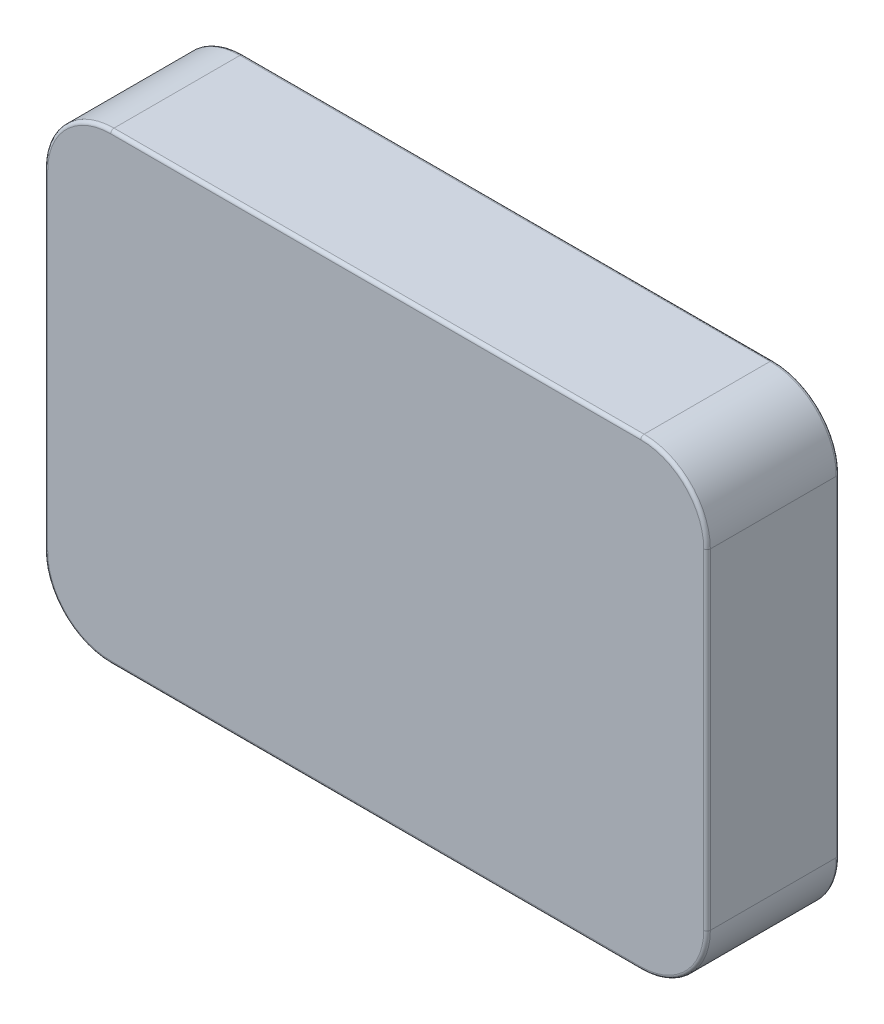
ISO-10303-21;
HEADER;
FILE_DESCRIPTION(('STEP AP214'),'2;1');
FILE_NAME('part.step','',(''),(''),'','','');
FILE_SCHEMA(('AUTOMOTIVE_DESIGN { 1 0 10303 214 1 1 1 1 }'));
ENDSEC;
DATA;
#1=APPLICATION_CONTEXT('core data for automotive mechanical design processes');
#2=APPLICATION_PROTOCOL_DEFINITION('international standard','automotive_design',2000,#1);
#3=PRODUCT_CONTEXT('',#1,'mechanical');
#4=PRODUCT('Part','Part','',(#3));
#5=PRODUCT_RELATED_PRODUCT_CATEGORY('part','',(#4));
#6=PRODUCT_DEFINITION_FORMATION('','',#4);
#7=PRODUCT_DEFINITION_CONTEXT('part definition',#1,'design');
#8=PRODUCT_DEFINITION('design','',#6,#7);
#9=PRODUCT_DEFINITION_SHAPE('','',#8);
#10=(LENGTH_UNIT() NAMED_UNIT(*) SI_UNIT(.MILLI.,.METRE.));
#11=(NAMED_UNIT(*) PLANE_ANGLE_UNIT() SI_UNIT($,.RADIAN.));
#12=(NAMED_UNIT(*) SI_UNIT($,.STERADIAN.) SOLID_ANGLE_UNIT());
#13=UNCERTAINTY_MEASURE_WITH_UNIT(LENGTH_MEASURE(1.E-05),#10,'distance_accuracy_value','');
#14=(GEOMETRIC_REPRESENTATION_CONTEXT(3) GLOBAL_UNCERTAINTY_ASSIGNED_CONTEXT((#13)) GLOBAL_UNIT_ASSIGNED_CONTEXT((#10,
#11,#12)) REPRESENTATION_CONTEXT('',''));
#15=CARTESIAN_POINT('',(0.,0.,0.));
#16=DIRECTION('',(0.,0.,1.));
#17=DIRECTION('',(1.,0.,0.));
#18=AXIS2_PLACEMENT_3D('',#15,#16,#17);
#19=CARTESIAN_POINT('',(50.,-34.925,20.));
#20=DIRECTION('',(-1.,0.,0.));
#21=DIRECTION('',(0.,0.,1.));
#22=AXIS2_PLACEMENT_3D('',#19,#20,#21);
#23=PLANE('',#22);
#24=DIRECTION('',(0.,0.,-1.));
#25=VECTOR('',#24,1.);
#26=CARTESIAN_POINT('',(50.,-24.925,20.));
#27=LINE('',#26,#25);
#28=CARTESIAN_POINT('',(50.,-24.925,19.5));
#29=VERTEX_POINT('',#28);
#30=CARTESIAN_POINT('',(50.,-24.925,0.5));
#31=VERTEX_POINT('',#30);
#32=EDGE_CURVE('E300',#29,#31,#27,.T.);
#33=ORIENTED_EDGE('',*,*,#32,.T.);
#34=DIRECTION('',(0.,1.,0.));
#35=VECTOR('',#34,1.);
#36=CARTESIAN_POINT('',(50.,24.925,0.5));
#37=LINE('',#36,#35);
#38=CARTESIAN_POINT('',(50.,24.925,0.5));
#39=VERTEX_POINT('',#38);
#40=EDGE_CURVE('E199',#31,#39,#37,.T.);
#41=ORIENTED_EDGE('',*,*,#40,.T.);
#42=DIRECTION('',(0.,0.,-1.));
#43=VECTOR('',#42,1.);
#44=CARTESIAN_POINT('',(50.,24.925,20.));
#45=LINE('',#44,#43);
#46=CARTESIAN_POINT('',(50.,24.925,19.5));
#47=VERTEX_POINT('',#46);
#48=EDGE_CURVE('E296',#39,#47,#45,.F.);
#49=ORIENTED_EDGE('',*,*,#48,.T.);
#50=DIRECTION('',(0.,1.,0.));
#51=VECTOR('',#50,1.);
#52=CARTESIAN_POINT('',(50.,-34.925,19.5));
#53=LINE('',#52,#51);
#54=EDGE_CURVE('E197',#47,#29,#53,.F.);
#55=ORIENTED_EDGE('',*,*,#54,.T.);
#56=EDGE_LOOP('',(#33,#41,#49,#55));
#57=FACE_BOUND('',#56,.T.);
#58=ADVANCED_FACE('F34',(#57),#23,.F.);
#59=CARTESIAN_POINT('',(-50.,34.925,20.));
#60=DIRECTION('',(0.,-1.,0.));
#61=DIRECTION('',(0.,0.,-1.));
#62=AXIS2_PLACEMENT_3D('',#59,#60,#61);
#63=PLANE('',#62);
#64=DIRECTION('',(0.,0.,-1.));
#65=VECTOR('',#64,1.);
#66=CARTESIAN_POINT('',(40.,34.925,20.));
#67=LINE('',#66,#65);
#68=CARTESIAN_POINT('',(40.,34.925,19.5));
#69=VERTEX_POINT('',#68);
#70=CARTESIAN_POINT('',(40.,34.925,0.5));
#71=VERTEX_POINT('',#70);
#72=EDGE_CURVE('E173',#69,#71,#67,.T.);
#73=ORIENTED_EDGE('',*,*,#72,.T.);
#74=DIRECTION('',(-1.,0.,0.));
#75=VECTOR('',#74,1.);
#76=CARTESIAN_POINT('',(-40.,34.925,0.5));
#77=LINE('',#76,#75);
#78=CARTESIAN_POINT('',(-40.,34.925,0.5));
#79=VERTEX_POINT('',#78);
#80=EDGE_CURVE('E11',#71,#79,#77,.T.);
#81=ORIENTED_EDGE('',*,*,#80,.T.);
#82=DIRECTION('',(0.,0.,-1.));
#83=VECTOR('',#82,1.);
#84=CARTESIAN_POINT('',(-40.,34.925,20.));
#85=LINE('',#84,#83);
#86=CARTESIAN_POINT('',(-40.,34.925,19.5));
#87=VERTEX_POINT('',#86);
#88=EDGE_CURVE('E176',#79,#87,#85,.F.);
#89=ORIENTED_EDGE('',*,*,#88,.T.);
#90=DIRECTION('',(-1.,0.,0.));
#91=VECTOR('',#90,1.);
#92=CARTESIAN_POINT('',(-50.,34.925,19.5));
#93=LINE('',#92,#91);
#94=EDGE_CURVE('E43',#87,#69,#93,.F.);
#95=ORIENTED_EDGE('',*,*,#94,.T.);
#96=EDGE_LOOP('',(#73,#81,#89,#95));
#97=FACE_BOUND('',#96,.T.);
#98=ADVANCED_FACE('F310',(#97),#63,.F.);
#99=CARTESIAN_POINT('',(-50.,-34.925,20.));
#100=DIRECTION('',(1.,0.,0.));
#101=DIRECTION('',(0.,0.,-1.));
#102=AXIS2_PLACEMENT_3D('',#99,#100,#101);
#103=PLANE('',#102);
#104=DIRECTION('',(0.,0.,-1.));
#105=VECTOR('',#104,1.);
#106=CARTESIAN_POINT('',(-50.,24.925,20.));
#107=LINE('',#106,#105);
#108=CARTESIAN_POINT('',(-50.,24.925,19.5));
#109=VERTEX_POINT('',#108);
#110=CARTESIAN_POINT('',(-50.,24.925,0.5));
#111=VERTEX_POINT('',#110);
#112=EDGE_CURVE('E297',#109,#111,#107,.T.);
#113=ORIENTED_EDGE('',*,*,#112,.T.);
#114=DIRECTION('',(0.,-1.,0.));
#115=VECTOR('',#114,1.);
#116=CARTESIAN_POINT('',(-50.,-24.925,0.5));
#117=LINE('',#116,#115);
#118=CARTESIAN_POINT('',(-50.,-24.925,0.5));
#119=VERTEX_POINT('',#118);
#120=EDGE_CURVE('E215',#111,#119,#117,.T.);
#121=ORIENTED_EDGE('',*,*,#120,.T.);
#122=DIRECTION('',(0.,0.,-1.));
#123=VECTOR('',#122,1.);
#124=CARTESIAN_POINT('',(-50.,-24.925,20.));
#125=LINE('',#124,#123);
#126=CARTESIAN_POINT('',(-50.,-24.925,19.5));
#127=VERTEX_POINT('',#126);
#128=EDGE_CURVE('E287',#119,#127,#125,.F.);
#129=ORIENTED_EDGE('',*,*,#128,.T.);
#130=DIRECTION('',(0.,-1.,0.));
#131=VECTOR('',#130,1.);
#132=CARTESIAN_POINT('',(-50.,-34.925,19.5));
#133=LINE('',#132,#131);
#134=EDGE_CURVE('E213',#127,#109,#133,.F.);
#135=ORIENTED_EDGE('',*,*,#134,.T.);
#136=EDGE_LOOP('',(#113,#121,#129,#135));
#137=FACE_BOUND('',#136,.T.);
#138=ADVANCED_FACE('F293',(#137),#103,.F.);
#139=CARTESIAN_POINT('',(-50.,-34.925,20.));
#140=DIRECTION('',(0.,1.,0.));
#141=DIRECTION('',(0.,0.,1.));
#142=AXIS2_PLACEMENT_3D('',#139,#140,#141);
#143=PLANE('',#142);
#144=DIRECTION('',(0.,0.,-1.));
#145=VECTOR('',#144,1.);
#146=CARTESIAN_POINT('',(-40.,-34.925,20.));
#147=LINE('',#146,#145);
#148=CARTESIAN_POINT('',(-40.,-34.925,19.5));
#149=VERTEX_POINT('',#148);
#150=CARTESIAN_POINT('',(-40.,-34.925,0.5));
#151=VERTEX_POINT('',#150);
#152=EDGE_CURVE('E290',#149,#151,#147,.T.);
#153=ORIENTED_EDGE('',*,*,#152,.T.);
#154=DIRECTION('',(1.,0.,0.));
#155=VECTOR('',#154,1.);
#156=CARTESIAN_POINT('',(40.,-34.925,0.5));
#157=LINE('',#156,#155);
#158=CARTESIAN_POINT('',(40.,-34.925,0.5));
#159=VERTEX_POINT('',#158);
#160=EDGE_CURVE('E207',#151,#159,#157,.T.);
#161=ORIENTED_EDGE('',*,*,#160,.T.);
#162=DIRECTION('',(0.,0.,-1.));
#163=VECTOR('',#162,1.);
#164=CARTESIAN_POINT('',(40.,-34.925,20.));
#165=LINE('',#164,#163);
#166=CARTESIAN_POINT('',(40.,-34.925,19.5));
#167=VERTEX_POINT('',#166);
#168=EDGE_CURVE('E250',#159,#167,#165,.F.);
#169=ORIENTED_EDGE('',*,*,#168,.T.);
#170=DIRECTION('',(1.,0.,0.));
#171=VECTOR('',#170,1.);
#172=CARTESIAN_POINT('',(-50.,-34.925,19.5));
#173=LINE('',#172,#171);
#174=EDGE_CURVE('E205',#167,#149,#173,.F.);
#175=ORIENTED_EDGE('',*,*,#174,.T.);
#176=EDGE_LOOP('',(#153,#161,#169,#175));
#177=FACE_BOUND('',#176,.T.);
#178=ADVANCED_FACE('F539',(#177),#143,.F.);
#179=CARTESIAN_POINT('',(0.,0.,20.));
#180=DIRECTION('',(0.,0.,-1.));
#181=DIRECTION('',(-1.,0.,0.));
#182=AXIS2_PLACEMENT_3D('',#179,#180,#181);
#183=PLANE('',#182);
#184=DIRECTION('',(0.,1.,0.));
#185=VECTOR('',#184,1.);
#186=CARTESIAN_POINT('',(49.5,0.,20.));
#187=LINE('',#186,#185);
#188=CARTESIAN_POINT('',(49.5,-24.925,20.));
#189=VERTEX_POINT('',#188);
#190=CARTESIAN_POINT('',(49.5,24.925,20.));
#191=VERTEX_POINT('',#190);
#192=EDGE_CURVE('E51',#189,#191,#187,.T.);
#193=ORIENTED_EDGE('',*,*,#192,.T.);
#194=CARTESIAN_POINT('',(40.,24.925,20.));
#195=DIRECTION('',(0.,0.,-1.));
#196=DIRECTION('',(-1.,0.,0.));
#197=AXIS2_PLACEMENT_3D('',#194,#195,#196);
#198=CIRCLE('',#197,9.5);
#199=CARTESIAN_POINT('',(40.,34.425,20.));
#200=VERTEX_POINT('',#199);
#201=EDGE_CURVE('E232',#191,#200,#198,.F.);
#202=ORIENTED_EDGE('',*,*,#201,.T.);
#203=DIRECTION('',(-1.,0.,0.));
#204=VECTOR('',#203,1.);
#205=CARTESIAN_POINT('',(0.,34.425,20.));
#206=LINE('',#205,#204);
#207=CARTESIAN_POINT('',(-40.,34.425,20.));
#208=VERTEX_POINT('',#207);
#209=EDGE_CURVE('E220',#200,#208,#206,.T.);
#210=ORIENTED_EDGE('',*,*,#209,.T.);
#211=CARTESIAN_POINT('',(-40.,24.925,20.));
#212=DIRECTION('',(0.,0.,-1.));
#213=DIRECTION('',(-1.,0.,0.));
#214=AXIS2_PLACEMENT_3D('',#211,#212,#213);
#215=CIRCLE('',#214,9.5);
#216=CARTESIAN_POINT('',(-49.5,24.925,20.));
#217=VERTEX_POINT('',#216);
#218=EDGE_CURVE('E222',#208,#217,#215,.F.);
#219=ORIENTED_EDGE('',*,*,#218,.T.);
#220=DIRECTION('',(0.,-1.,0.));
#221=VECTOR('',#220,1.);
#222=CARTESIAN_POINT('',(-49.5,0.,20.));
#223=LINE('',#222,#221);
#224=CARTESIAN_POINT('',(-49.5,-24.925,20.));
#225=VERTEX_POINT('',#224);
#226=EDGE_CURVE('E224',#217,#225,#223,.T.);
#227=ORIENTED_EDGE('',*,*,#226,.T.);
#228=CARTESIAN_POINT('',(-40.,-24.925,20.));
#229=DIRECTION('',(0.,0.,-1.));
#230=DIRECTION('',(-1.,0.,0.));
#231=AXIS2_PLACEMENT_3D('',#228,#229,#230);
#232=CIRCLE('',#231,9.5);
#233=CARTESIAN_POINT('',(-40.,-34.425,20.));
#234=VERTEX_POINT('',#233);
#235=EDGE_CURVE('E226',#225,#234,#232,.F.);
#236=ORIENTED_EDGE('',*,*,#235,.T.);
#237=DIRECTION('',(1.,0.,0.));
#238=VECTOR('',#237,1.);
#239=CARTESIAN_POINT('',(0.,-34.425,20.));
#240=LINE('',#239,#238);
#241=CARTESIAN_POINT('',(40.,-34.425,20.));
#242=VERTEX_POINT('',#241);
#243=EDGE_CURVE('E228',#234,#242,#240,.T.);
#244=ORIENTED_EDGE('',*,*,#243,.T.);
#245=CARTESIAN_POINT('',(40.,-24.925,20.));
#246=DIRECTION('',(0.,0.,-1.));
#247=DIRECTION('',(-1.,0.,0.));
#248=AXIS2_PLACEMENT_3D('',#245,#246,#247);
#249=CIRCLE('',#248,9.5);
#250=EDGE_CURVE('E56',#242,#189,#249,.F.);
#251=ORIENTED_EDGE('',*,*,#250,.T.);
#252=EDGE_LOOP('',(#193,#202,#210,#219,#227,#236,#244,#251));
#253=FACE_BOUND('',#252,.T.);
#254=ADVANCED_FACE('F531',(#253),#183,.F.);
#255=CARTESIAN_POINT('',(0.,0.,0.));
#256=DIRECTION('',(0.,0.,-1.));
#257=DIRECTION('',(-1.,0.,0.));
#258=AXIS2_PLACEMENT_3D('',#255,#256,#257);
#259=PLANE('',#258);
#260=DIRECTION('',(-1.,0.,0.));
#261=VECTOR('',#260,1.);
#262=CARTESIAN_POINT('',(40.,34.425,0.));
#263=LINE('',#262,#261);
#264=CARTESIAN_POINT('',(-40.,34.425,0.));
#265=VERTEX_POINT('',#264);
#266=CARTESIAN_POINT('',(40.,34.425,0.));
#267=VERTEX_POINT('',#266);
#268=EDGE_CURVE('E152',#265,#267,#263,.F.);
#269=ORIENTED_EDGE('',*,*,#268,.T.);
#270=CARTESIAN_POINT('',(40.,24.925,0.));
#271=DIRECTION('',(0.,0.,-1.));
#272=DIRECTION('',(-1.,0.,0.));
#273=AXIS2_PLACEMENT_3D('',#270,#271,#272);
#274=CIRCLE('',#273,9.5);
#275=CARTESIAN_POINT('',(49.5,24.925,0.));
#276=VERTEX_POINT('',#275);
#277=EDGE_CURVE('E189',#267,#276,#274,.T.);
#278=ORIENTED_EDGE('',*,*,#277,.T.);
#279=DIRECTION('',(0.,1.,0.));
#280=VECTOR('',#279,1.);
#281=CARTESIAN_POINT('',(49.5,-24.925,0.));
#282=LINE('',#281,#280);
#283=CARTESIAN_POINT('',(49.5,-24.925,0.));
#284=VERTEX_POINT('',#283);
#285=EDGE_CURVE('E187',#276,#284,#282,.F.);
#286=ORIENTED_EDGE('',*,*,#285,.T.);
#287=CARTESIAN_POINT('',(40.,-24.925,0.));
#288=DIRECTION('',(0.,0.,-1.));
#289=DIRECTION('',(-1.,0.,0.));
#290=AXIS2_PLACEMENT_3D('',#287,#288,#289);
#291=CIRCLE('',#290,9.5);
#292=CARTESIAN_POINT('',(40.,-34.425,0.));
#293=VERTEX_POINT('',#292);
#294=EDGE_CURVE('E185',#284,#293,#291,.T.);
#295=ORIENTED_EDGE('',*,*,#294,.T.);
#296=DIRECTION('',(1.,0.,0.));
#297=VECTOR('',#296,1.);
#298=CARTESIAN_POINT('',(-40.,-34.425,0.));
#299=LINE('',#298,#297);
#300=CARTESIAN_POINT('',(-40.,-34.425,0.));
#301=VERTEX_POINT('',#300);
#302=EDGE_CURVE('E183',#293,#301,#299,.F.);
#303=ORIENTED_EDGE('',*,*,#302,.T.);
#304=CARTESIAN_POINT('',(-40.,-24.925,0.));
#305=DIRECTION('',(0.,0.,-1.));
#306=DIRECTION('',(-1.,0.,0.));
#307=AXIS2_PLACEMENT_3D('',#304,#305,#306);
#308=CIRCLE('',#307,9.5);
#309=CARTESIAN_POINT('',(-49.5,-24.925,0.));
#310=VERTEX_POINT('',#309);
#311=EDGE_CURVE('E181',#301,#310,#308,.T.);
#312=ORIENTED_EDGE('',*,*,#311,.T.);
#313=DIRECTION('',(0.,-1.,0.));
#314=VECTOR('',#313,1.);
#315=CARTESIAN_POINT('',(-49.5,24.925,0.));
#316=LINE('',#315,#314);
#317=CARTESIAN_POINT('',(-49.5,24.925,0.));
#318=VERTEX_POINT('',#317);
#319=EDGE_CURVE('E155',#310,#318,#316,.F.);
#320=ORIENTED_EDGE('',*,*,#319,.T.);
#321=CARTESIAN_POINT('',(-40.,24.925,0.));
#322=DIRECTION('',(0.,0.,-1.));
#323=DIRECTION('',(-1.,0.,0.));
#324=AXIS2_PLACEMENT_3D('',#321,#322,#323);
#325=CIRCLE('',#324,9.5);
#326=EDGE_CURVE('E147',#318,#265,#325,.T.);
#327=ORIENTED_EDGE('',*,*,#326,.T.);
#328=EDGE_LOOP('',(#269,#278,#286,#295,#303,#312,#320,#327));
#329=FACE_BOUND('',#328,.T.);
#330=ADVANCED_FACE('F149',(#329),#259,.T.);
#331=CARTESIAN_POINT('',(-40.,-24.925,20.));
#332=DIRECTION('',(0.,0.,-1.));
#333=DIRECTION('',(-1.,0.,0.));
#334=AXIS2_PLACEMENT_3D('',#331,#332,#333);
#335=CYLINDRICAL_SURFACE('',#334,10.);
#336=ORIENTED_EDGE('',*,*,#128,.F.);
#337=CARTESIAN_POINT('',(-40.,-24.925,0.5));
#338=DIRECTION('',(0.,0.,-1.));
#339=DIRECTION('',(-1.,0.,0.));
#340=AXIS2_PLACEMENT_3D('',#337,#338,#339);
#341=CIRCLE('',#340,10.);
#342=EDGE_CURVE('E211',#119,#151,#341,.F.);
#343=ORIENTED_EDGE('',*,*,#342,.T.);
#344=ORIENTED_EDGE('',*,*,#152,.F.);
#345=CARTESIAN_POINT('',(-40.,-24.925,19.5));
#346=DIRECTION('',(0.,0.,-1.));
#347=DIRECTION('',(-1.,0.,0.));
#348=AXIS2_PLACEMENT_3D('',#345,#346,#347);
#349=CIRCLE('',#348,10.);
#350=EDGE_CURVE('E209',#149,#127,#349,.T.);
#351=ORIENTED_EDGE('',*,*,#350,.T.);
#352=EDGE_LOOP('',(#336,#343,#344,#351));
#353=FACE_BOUND('',#352,.T.);
#354=ADVANCED_FACE('F286',(#353),#335,.T.);
#355=CARTESIAN_POINT('',(40.,-24.925,20.));
#356=DIRECTION('',(0.,0.,-1.));
#357=DIRECTION('',(-1.,0.,0.));
#358=AXIS2_PLACEMENT_3D('',#355,#356,#357);
#359=CYLINDRICAL_SURFACE('',#358,10.);
#360=ORIENTED_EDGE('',*,*,#168,.F.);
#361=CARTESIAN_POINT('',(40.,-24.925,0.5));
#362=DIRECTION('',(0.,0.,-1.));
#363=DIRECTION('',(-1.,0.,0.));
#364=AXIS2_PLACEMENT_3D('',#361,#362,#363);
#365=CIRCLE('',#364,10.);
#366=EDGE_CURVE('E203',#159,#31,#365,.F.);
#367=ORIENTED_EDGE('',*,*,#366,.T.);
#368=ORIENTED_EDGE('',*,*,#32,.F.);
#369=CARTESIAN_POINT('',(40.,-24.925,19.5));
#370=DIRECTION('',(0.,0.,-1.));
#371=DIRECTION('',(-1.,0.,0.));
#372=AXIS2_PLACEMENT_3D('',#369,#370,#371);
#373=CIRCLE('',#372,10.);
#374=EDGE_CURVE('E201',#29,#167,#373,.T.);
#375=ORIENTED_EDGE('',*,*,#374,.T.);
#376=EDGE_LOOP('',(#360,#367,#368,#375));
#377=FACE_BOUND('',#376,.T.);
#378=ADVANCED_FACE('F376',(#377),#359,.T.);
#379=CARTESIAN_POINT('',(40.,24.925,20.));
#380=DIRECTION('',(0.,0.,-1.));
#381=DIRECTION('',(-1.,0.,0.));
#382=AXIS2_PLACEMENT_3D('',#379,#380,#381);
#383=CYLINDRICAL_SURFACE('',#382,10.);
#384=ORIENTED_EDGE('',*,*,#48,.F.);
#385=CARTESIAN_POINT('',(40.,24.925,0.5));
#386=DIRECTION('',(0.,0.,-1.));
#387=DIRECTION('',(-1.,0.,0.));
#388=AXIS2_PLACEMENT_3D('',#385,#386,#387);
#389=CIRCLE('',#388,10.);
#390=EDGE_CURVE('E194',#39,#71,#389,.F.);
#391=ORIENTED_EDGE('',*,*,#390,.T.);
#392=ORIENTED_EDGE('',*,*,#72,.F.);
#393=CARTESIAN_POINT('',(40.,24.925,19.5));
#394=DIRECTION('',(0.,0.,-1.));
#395=DIRECTION('',(-1.,0.,0.));
#396=AXIS2_PLACEMENT_3D('',#393,#394,#395);
#397=CIRCLE('',#396,10.);
#398=EDGE_CURVE('E191',#69,#47,#397,.T.);
#399=ORIENTED_EDGE('',*,*,#398,.T.);
#400=EDGE_LOOP('',(#384,#391,#392,#399));
#401=FACE_BOUND('',#400,.T.);
#402=ADVANCED_FACE('F329',(#401),#383,.T.);
#403=CARTESIAN_POINT('',(-40.,24.925,20.));
#404=DIRECTION('',(0.,0.,-1.));
#405=DIRECTION('',(-1.,0.,0.));
#406=AXIS2_PLACEMENT_3D('',#403,#404,#405);
#407=CYLINDRICAL_SURFACE('',#406,10.);
#408=ORIENTED_EDGE('',*,*,#88,.F.);
#409=CARTESIAN_POINT('',(-40.,24.925,0.5));
#410=DIRECTION('',(0.,0.,-1.));
#411=DIRECTION('',(-1.,0.,0.));
#412=AXIS2_PLACEMENT_3D('',#409,#410,#411);
#413=CIRCLE('',#412,10.);
#414=EDGE_CURVE('E164',#79,#111,#413,.F.);
#415=ORIENTED_EDGE('',*,*,#414,.T.);
#416=ORIENTED_EDGE('',*,*,#112,.F.);
#417=CARTESIAN_POINT('',(-40.,24.925,19.5));
#418=DIRECTION('',(0.,0.,-1.));
#419=DIRECTION('',(-1.,0.,0.));
#420=AXIS2_PLACEMENT_3D('',#417,#418,#419);
#421=CIRCLE('',#420,10.);
#422=EDGE_CURVE('E217',#109,#87,#421,.T.);
#423=ORIENTED_EDGE('',*,*,#422,.T.);
#424=EDGE_LOOP('',(#408,#415,#416,#423));
#425=FACE_BOUND('',#424,.T.);
#426=ADVANCED_FACE('F364',(#425),#407,.T.);
#427=CARTESIAN_POINT('',(-40.,-24.925,0.5));
#428=DIRECTION('',(0.,0.,-1.));
#429=DIRECTION('',(-1.,0.,0.));
#430=AXIS2_PLACEMENT_3D('',#427,#428,#429);
#431=TOROIDAL_SURFACE('',#430,9.5,0.5);
#432=CARTESIAN_POINT('',(-40.,-34.425,0.5));
#433=DIRECTION('',(1.,0.,0.));
#434=DIRECTION('',(0.,0.,-1.));
#435=AXIS2_PLACEMENT_3D('',#432,#433,#434);
#436=CIRCLE('',#435,0.5);
#437=EDGE_CURVE('E244',#151,#301,#436,.T.);
#438=ORIENTED_EDGE('',*,*,#437,.F.);
#439=ORIENTED_EDGE('',*,*,#342,.F.);
#440=CARTESIAN_POINT('',(-49.5,-24.925,0.5));
#441=DIRECTION('',(0.,1.,0.));
#442=DIRECTION('',(0.,0.,1.));
#443=AXIS2_PLACEMENT_3D('',#440,#441,#442);
#444=CIRCLE('',#443,0.5);
#445=EDGE_CURVE('E247',#310,#119,#444,.T.);
#446=ORIENTED_EDGE('',*,*,#445,.F.);
#447=ORIENTED_EDGE('',*,*,#311,.F.);
#448=EDGE_LOOP('',(#438,#439,#446,#447));
#449=FACE_BOUND('',#448,.T.);
#450=ADVANCED_FACE('F354',(#449),#431,.T.);
#451=CARTESIAN_POINT('',(-49.5,-34.925,0.5));
#452=DIRECTION('',(0.,1.,0.));
#453=DIRECTION('',(0.,0.,1.));
#454=AXIS2_PLACEMENT_3D('',#451,#452,#453);
#455=CYLINDRICAL_SURFACE('',#454,0.5);
#456=ORIENTED_EDGE('',*,*,#445,.T.);
#457=ORIENTED_EDGE('',*,*,#120,.F.);
#458=CARTESIAN_POINT('',(-49.5,24.925,0.5));
#459=DIRECTION('',(0.,1.,0.));
#460=DIRECTION('',(0.,0.,1.));
#461=AXIS2_PLACEMENT_3D('',#458,#459,#460);
#462=CIRCLE('',#461,0.5);
#463=EDGE_CURVE('E242',#318,#111,#462,.T.);
#464=ORIENTED_EDGE('',*,*,#463,.F.);
#465=ORIENTED_EDGE('',*,*,#319,.F.);
#466=EDGE_LOOP('',(#456,#457,#464,#465));
#467=FACE_BOUND('',#466,.T.);
#468=ADVANCED_FACE('F356',(#467),#455,.T.);
#469=CARTESIAN_POINT('',(-50.,-34.425,0.5));
#470=DIRECTION('',(-1.,0.,0.));
#471=DIRECTION('',(0.,0.,1.));
#472=AXIS2_PLACEMENT_3D('',#469,#470,#471);
#473=CYLINDRICAL_SURFACE('',#472,0.5);
#474=ORIENTED_EDGE('',*,*,#437,.T.);
#475=ORIENTED_EDGE('',*,*,#302,.F.);
#476=CARTESIAN_POINT('',(40.,-34.425,0.5));
#477=DIRECTION('',(1.,0.,0.));
#478=DIRECTION('',(0.,0.,-1.));
#479=AXIS2_PLACEMENT_3D('',#476,#477,#478);
#480=CIRCLE('',#479,0.5);
#481=EDGE_CURVE('E167',#159,#293,#480,.T.);
#482=ORIENTED_EDGE('',*,*,#481,.F.);
#483=ORIENTED_EDGE('',*,*,#160,.F.);
#484=EDGE_LOOP('',(#474,#475,#482,#483));
#485=FACE_BOUND('',#484,.T.);
#486=ADVANCED_FACE('F349',(#485),#473,.T.);
#487=CARTESIAN_POINT('',(-40.,24.925,0.5));
#488=DIRECTION('',(0.,0.,-1.));
#489=DIRECTION('',(-1.,0.,0.));
#490=AXIS2_PLACEMENT_3D('',#487,#488,#489);
#491=TOROIDAL_SURFACE('',#490,9.5,0.5);
#492=ORIENTED_EDGE('',*,*,#463,.T.);
#493=ORIENTED_EDGE('',*,*,#414,.F.);
#494=CARTESIAN_POINT('',(-40.,34.425,0.5));
#495=DIRECTION('',(1.,0.,0.));
#496=DIRECTION('',(0.,0.,-1.));
#497=AXIS2_PLACEMENT_3D('',#494,#495,#496);
#498=CIRCLE('',#497,0.5);
#499=EDGE_CURVE('E162',#265,#79,#498,.T.);
#500=ORIENTED_EDGE('',*,*,#499,.F.);
#501=ORIENTED_EDGE('',*,*,#326,.F.);
#502=EDGE_LOOP('',(#492,#493,#500,#501));
#503=FACE_BOUND('',#502,.T.);
#504=ADVANCED_FACE('F163',(#503),#491,.T.);
#505=CARTESIAN_POINT('',(40.,-24.925,0.5));
#506=DIRECTION('',(0.,0.,-1.));
#507=DIRECTION('',(-1.,0.,0.));
#508=AXIS2_PLACEMENT_3D('',#505,#506,#507);
#509=TOROIDAL_SURFACE('',#508,9.5,0.5);
#510=ORIENTED_EDGE('',*,*,#481,.T.);
#511=ORIENTED_EDGE('',*,*,#294,.F.);
#512=CARTESIAN_POINT('',(49.5,-24.925,0.5));
#513=DIRECTION('',(0.,1.,0.));
#514=DIRECTION('',(0.,0.,1.));
#515=AXIS2_PLACEMENT_3D('',#512,#513,#514);
#516=CIRCLE('',#515,0.5);
#517=EDGE_CURVE('E168',#31,#284,#516,.T.);
#518=ORIENTED_EDGE('',*,*,#517,.F.);
#519=ORIENTED_EDGE('',*,*,#366,.F.);
#520=EDGE_LOOP('',(#510,#511,#518,#519));
#521=FACE_BOUND('',#520,.T.);
#522=ADVANCED_FACE('F344',(#521),#509,.T.);
#523=CARTESIAN_POINT('',(-50.,34.425,0.5));
#524=DIRECTION('',(1.,0.,0.));
#525=DIRECTION('',(0.,0.,-1.));
#526=AXIS2_PLACEMENT_3D('',#523,#524,#525);
#527=CYLINDRICAL_SURFACE('',#526,0.5);
#528=ORIENTED_EDGE('',*,*,#499,.T.);
#529=ORIENTED_EDGE('',*,*,#80,.F.);
#530=CARTESIAN_POINT('',(40.,34.425,0.5));
#531=DIRECTION('',(1.,0.,0.));
#532=DIRECTION('',(0.,0.,-1.));
#533=AXIS2_PLACEMENT_3D('',#530,#531,#532);
#534=CIRCLE('',#533,0.5);
#535=EDGE_CURVE('E171',#267,#71,#534,.T.);
#536=ORIENTED_EDGE('',*,*,#535,.F.);
#537=ORIENTED_EDGE('',*,*,#268,.F.);
#538=EDGE_LOOP('',(#528,#529,#536,#537));
#539=FACE_BOUND('',#538,.T.);
#540=ADVANCED_FACE('F170',(#539),#527,.T.);
#541=CARTESIAN_POINT('',(49.5,-34.925,0.5));
#542=DIRECTION('',(0.,-1.,0.));
#543=DIRECTION('',(0.,0.,-1.));
#544=AXIS2_PLACEMENT_3D('',#541,#542,#543);
#545=CYLINDRICAL_SURFACE('',#544,0.5);
#546=ORIENTED_EDGE('',*,*,#517,.T.);
#547=ORIENTED_EDGE('',*,*,#285,.F.);
#548=CARTESIAN_POINT('',(49.5,24.925,0.5));
#549=DIRECTION('',(0.,1.,0.));
#550=DIRECTION('',(0.,0.,1.));
#551=AXIS2_PLACEMENT_3D('',#548,#549,#550);
#552=CIRCLE('',#551,0.5);
#553=EDGE_CURVE('E235',#39,#276,#552,.T.);
#554=ORIENTED_EDGE('',*,*,#553,.F.);
#555=ORIENTED_EDGE('',*,*,#40,.F.);
#556=EDGE_LOOP('',(#546,#547,#554,#555));
#557=FACE_BOUND('',#556,.T.);
#558=ADVANCED_FACE('F337',(#557),#545,.T.);
#559=CARTESIAN_POINT('',(40.,24.925,0.5));
#560=DIRECTION('',(0.,0.,-1.));
#561=DIRECTION('',(-1.,0.,0.));
#562=AXIS2_PLACEMENT_3D('',#559,#560,#561);
#563=TOROIDAL_SURFACE('',#562,9.5,0.5);
#564=ORIENTED_EDGE('',*,*,#535,.T.);
#565=ORIENTED_EDGE('',*,*,#390,.F.);
#566=ORIENTED_EDGE('',*,*,#553,.T.);
#567=ORIENTED_EDGE('',*,*,#277,.F.);
#568=EDGE_LOOP('',(#564,#565,#566,#567));
#569=FACE_BOUND('',#568,.T.);
#570=ADVANCED_FACE('F340',(#569),#563,.T.);
#571=CARTESIAN_POINT('',(-40.,-24.925,19.5));
#572=DIRECTION('',(0.,0.,-1.));
#573=DIRECTION('',(-1.,0.,0.));
#574=AXIS2_PLACEMENT_3D('',#571,#572,#573);
#575=TOROIDAL_SURFACE('',#574,9.5,0.5);
#576=CARTESIAN_POINT('',(-49.5,-24.925,19.5));
#577=DIRECTION('',(0.,1.,0.));
#578=DIRECTION('',(0.,0.,1.));
#579=AXIS2_PLACEMENT_3D('',#576,#577,#578);
#580=CIRCLE('',#579,0.5);
#581=EDGE_CURVE('E266',#127,#225,#580,.T.);
#582=ORIENTED_EDGE('',*,*,#581,.F.);
#583=ORIENTED_EDGE('',*,*,#350,.F.);
#584=CARTESIAN_POINT('',(-40.,-34.425,19.5));
#585=DIRECTION('',(1.,0.,0.));
#586=DIRECTION('',(0.,0.,-1.));
#587=AXIS2_PLACEMENT_3D('',#584,#585,#586);
#588=CIRCLE('',#587,0.5);
#589=EDGE_CURVE('E38',#234,#149,#588,.T.);
#590=ORIENTED_EDGE('',*,*,#589,.F.);
#591=ORIENTED_EDGE('',*,*,#235,.F.);
#592=EDGE_LOOP('',(#582,#583,#590,#591));
#593=FACE_BOUND('',#592,.T.);
#594=ADVANCED_FACE('F36',(#593),#575,.T.);
#595=CARTESIAN_POINT('',(0.,-34.425,19.5));
#596=DIRECTION('',(1.,0.,0.));
#597=DIRECTION('',(0.,0.,-1.));
#598=AXIS2_PLACEMENT_3D('',#595,#596,#597);
#599=CYLINDRICAL_SURFACE('',#598,0.5);
#600=ORIENTED_EDGE('',*,*,#589,.T.);
#601=ORIENTED_EDGE('',*,*,#174,.F.);
#602=CARTESIAN_POINT('',(40.,-34.425,19.5));
#603=DIRECTION('',(1.,0.,0.));
#604=DIRECTION('',(0.,0.,-1.));
#605=AXIS2_PLACEMENT_3D('',#602,#603,#604);
#606=CIRCLE('',#605,0.5);
#607=EDGE_CURVE('E264',#242,#167,#606,.T.);
#608=ORIENTED_EDGE('',*,*,#607,.F.);
#609=ORIENTED_EDGE('',*,*,#243,.F.);
#610=EDGE_LOOP('',(#600,#601,#608,#609));
#611=FACE_BOUND('',#610,.T.);
#612=ADVANCED_FACE('F277',(#611),#599,.T.);
#613=CARTESIAN_POINT('',(-49.5,0.,19.5));
#614=DIRECTION('',(0.,-1.,0.));
#615=DIRECTION('',(0.,0.,-1.));
#616=AXIS2_PLACEMENT_3D('',#613,#614,#615);
#617=CYLINDRICAL_SURFACE('',#616,0.5);
#618=ORIENTED_EDGE('',*,*,#581,.T.);
#619=ORIENTED_EDGE('',*,*,#226,.F.);
#620=CARTESIAN_POINT('',(-49.5,24.925,19.5));
#621=DIRECTION('',(0.,1.,0.));
#622=DIRECTION('',(0.,0.,1.));
#623=AXIS2_PLACEMENT_3D('',#620,#621,#622);
#624=CIRCLE('',#623,0.5);
#625=EDGE_CURVE('E261',#109,#217,#624,.T.);
#626=ORIENTED_EDGE('',*,*,#625,.F.);
#627=ORIENTED_EDGE('',*,*,#134,.F.);
#628=EDGE_LOOP('',(#618,#619,#626,#627));
#629=FACE_BOUND('',#628,.T.);
#630=ADVANCED_FACE('F424',(#629),#617,.T.);
#631=CARTESIAN_POINT('',(40.,-24.925,19.5));
#632=DIRECTION('',(0.,0.,-1.));
#633=DIRECTION('',(-1.,0.,0.));
#634=AXIS2_PLACEMENT_3D('',#631,#632,#633);
#635=TOROIDAL_SURFACE('',#634,9.5,0.5);
#636=ORIENTED_EDGE('',*,*,#607,.T.);
#637=ORIENTED_EDGE('',*,*,#374,.F.);
#638=CARTESIAN_POINT('',(49.5,-24.925,19.5));
#639=DIRECTION('',(0.,1.,0.));
#640=DIRECTION('',(0.,0.,1.));
#641=AXIS2_PLACEMENT_3D('',#638,#639,#640);
#642=CIRCLE('',#641,0.5);
#643=EDGE_CURVE('E258',#189,#29,#642,.T.);
#644=ORIENTED_EDGE('',*,*,#643,.F.);
#645=ORIENTED_EDGE('',*,*,#250,.F.);
#646=EDGE_LOOP('',(#636,#637,#644,#645));
#647=FACE_BOUND('',#646,.T.);
#648=ADVANCED_FACE('F430',(#647),#635,.T.);
#649=CARTESIAN_POINT('',(-40.,24.925,19.5));
#650=DIRECTION('',(0.,0.,-1.));
#651=DIRECTION('',(-1.,0.,0.));
#652=AXIS2_PLACEMENT_3D('',#649,#650,#651);
#653=TOROIDAL_SURFACE('',#652,9.5,0.5);
#654=ORIENTED_EDGE('',*,*,#625,.T.);
#655=ORIENTED_EDGE('',*,*,#218,.F.);
#656=CARTESIAN_POINT('',(-40.,34.425,19.5));
#657=DIRECTION('',(1.,0.,0.));
#658=DIRECTION('',(0.,0.,-1.));
#659=AXIS2_PLACEMENT_3D('',#656,#657,#658);
#660=CIRCLE('',#659,0.5);
#661=EDGE_CURVE('E255',#87,#208,#660,.T.);
#662=ORIENTED_EDGE('',*,*,#661,.F.);
#663=ORIENTED_EDGE('',*,*,#422,.F.);
#664=EDGE_LOOP('',(#654,#655,#662,#663));
#665=FACE_BOUND('',#664,.T.);
#666=ADVANCED_FACE('F317',(#665),#653,.T.);
#667=CARTESIAN_POINT('',(49.5,0.,19.5));
#668=DIRECTION('',(0.,1.,0.));
#669=DIRECTION('',(0.,0.,1.));
#670=AXIS2_PLACEMENT_3D('',#667,#668,#669);
#671=CYLINDRICAL_SURFACE('',#670,0.5);
#672=ORIENTED_EDGE('',*,*,#643,.T.);
#673=ORIENTED_EDGE('',*,*,#54,.F.);
#674=CARTESIAN_POINT('',(49.5,24.925,19.5));
#675=DIRECTION('',(0.,1.,0.));
#676=DIRECTION('',(0.,0.,1.));
#677=AXIS2_PLACEMENT_3D('',#674,#675,#676);
#678=CIRCLE('',#677,0.5);
#679=EDGE_CURVE('E253',#191,#47,#678,.T.);
#680=ORIENTED_EDGE('',*,*,#679,.F.);
#681=ORIENTED_EDGE('',*,*,#192,.F.);
#682=EDGE_LOOP('',(#672,#673,#680,#681));
#683=FACE_BOUND('',#682,.T.);
#684=ADVANCED_FACE('F444',(#683),#671,.T.);
#685=CARTESIAN_POINT('',(0.,34.425,19.5));
#686=DIRECTION('',(-1.,0.,0.));
#687=DIRECTION('',(0.,0.,1.));
#688=AXIS2_PLACEMENT_3D('',#685,#686,#687);
#689=CYLINDRICAL_SURFACE('',#688,0.5);
#690=ORIENTED_EDGE('',*,*,#661,.T.);
#691=ORIENTED_EDGE('',*,*,#209,.F.);
#692=CARTESIAN_POINT('',(40.,34.425,19.5));
#693=DIRECTION('',(1.,0.,0.));
#694=DIRECTION('',(0.,0.,-1.));
#695=AXIS2_PLACEMENT_3D('',#692,#693,#694);
#696=CIRCLE('',#695,0.5);
#697=EDGE_CURVE('E251',#69,#200,#696,.T.);
#698=ORIENTED_EDGE('',*,*,#697,.F.);
#699=ORIENTED_EDGE('',*,*,#94,.F.);
#700=EDGE_LOOP('',(#690,#691,#698,#699));
#701=FACE_BOUND('',#700,.T.);
#702=ADVANCED_FACE('F321',(#701),#689,.T.);
#703=CARTESIAN_POINT('',(40.,24.925,19.5));
#704=DIRECTION('',(0.,0.,-1.));
#705=DIRECTION('',(-1.,0.,0.));
#706=AXIS2_PLACEMENT_3D('',#703,#704,#705);
#707=TOROIDAL_SURFACE('',#706,9.5,0.5);
#708=ORIENTED_EDGE('',*,*,#679,.T.);
#709=ORIENTED_EDGE('',*,*,#398,.F.);
#710=ORIENTED_EDGE('',*,*,#697,.T.);
#711=ORIENTED_EDGE('',*,*,#201,.F.);
#712=EDGE_LOOP('',(#708,#709,#710,#711));
#713=FACE_BOUND('',#712,.T.);
#714=ADVANCED_FACE('F325',(#713),#707,.T.);
#715=CLOSED_SHELL('',(#58,#98,#138,#178,#254,#330,#354,#378,#402,#426,#450,#468,#486,#504,#522,
#540,#558,#570,#594,#612,#630,#648,#666,#684,#702,#714));
#716=MANIFOLD_SOLID_BREP('B2',#715);
#717=ADVANCED_BREP_SHAPE_REPRESENTATION('',(#18,#716),#14);
#718=SHAPE_DEFINITION_REPRESENTATION(#9,#717);
ENDSEC;
END-ISO-10303-21;
